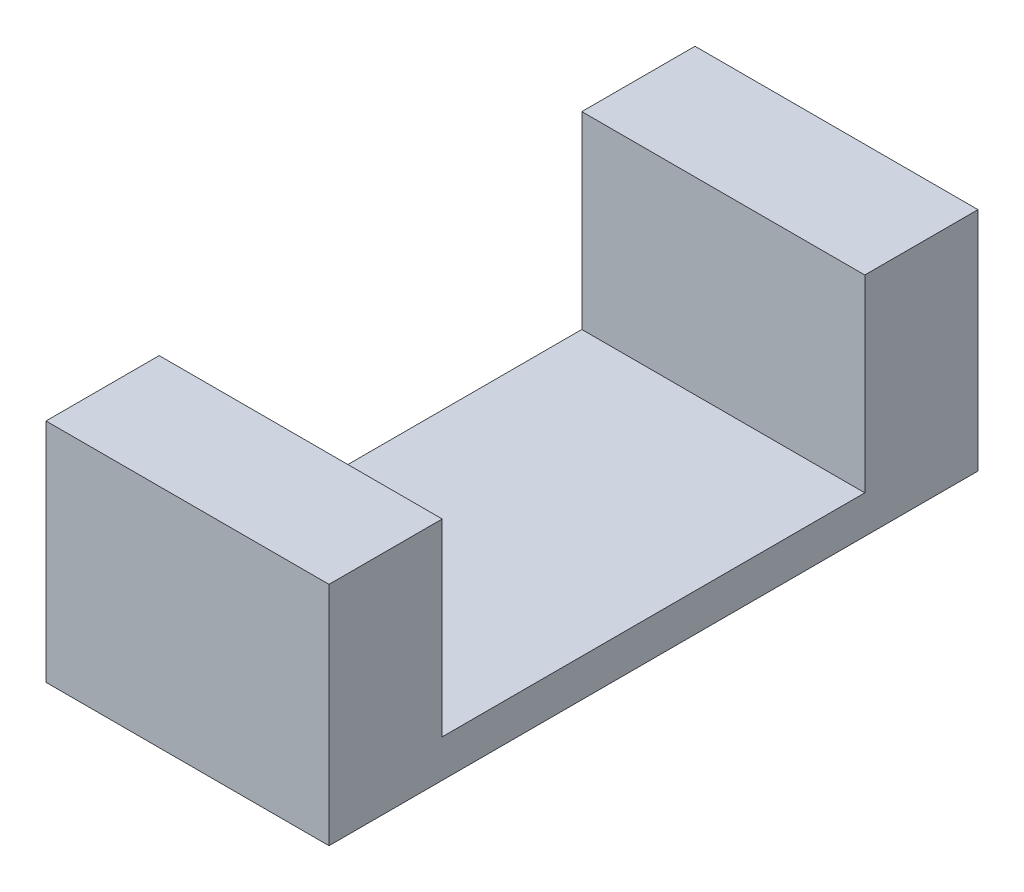
ISO-10303-21;
HEADER;
FILE_DESCRIPTION(('STEP AP214'),'2;1');
FILE_NAME('part.step','',(''),(''),'','','');
FILE_SCHEMA(('AUTOMOTIVE_DESIGN { 1 0 10303 214 1 1 1 1 }'));
ENDSEC;
DATA;
#1=APPLICATION_CONTEXT('core data for automotive mechanical design processes');
#2=APPLICATION_PROTOCOL_DEFINITION('international standard','automotive_design',2000,#1);
#3=PRODUCT_CONTEXT('',#1,'mechanical');
#4=PRODUCT('Part','Part','',(#3));
#5=PRODUCT_RELATED_PRODUCT_CATEGORY('part','',(#4));
#6=PRODUCT_DEFINITION_FORMATION('','',#4);
#7=PRODUCT_DEFINITION_CONTEXT('part definition',#1,'design');
#8=PRODUCT_DEFINITION('design','',#6,#7);
#9=PRODUCT_DEFINITION_SHAPE('','',#8);
#10=(LENGTH_UNIT() NAMED_UNIT(*) SI_UNIT(.MILLI.,.METRE.));
#11=(NAMED_UNIT(*) PLANE_ANGLE_UNIT() SI_UNIT($,.RADIAN.));
#12=(NAMED_UNIT(*) SI_UNIT($,.STERADIAN.) SOLID_ANGLE_UNIT());
#13=UNCERTAINTY_MEASURE_WITH_UNIT(LENGTH_MEASURE(1.E-05),#10,'distance_accuracy_value','');
#14=(GEOMETRIC_REPRESENTATION_CONTEXT(3) GLOBAL_UNCERTAINTY_ASSIGNED_CONTEXT((#13)) GLOBAL_UNIT_ASSIGNED_CONTEXT((#10,
#11,#12)) REPRESENTATION_CONTEXT('',''));
#15=CARTESIAN_POINT('',(0.,0.,0.));
#16=DIRECTION('',(0.,0.,1.));
#17=DIRECTION('',(1.,0.,0.));
#18=AXIS2_PLACEMENT_3D('',#15,#16,#17);
#19=CARTESIAN_POINT('',(20.5,2.77,13.36));
#20=DIRECTION('',(0.,0.,-1.));
#21=DIRECTION('',(-1.,0.,0.));
#22=AXIS2_PLACEMENT_3D('',#19,#20,#21);
#23=PLANE('',#22);
#24=DIRECTION('',(0.,1.,0.));
#25=VECTOR('',#24,1.);
#26=CARTESIAN_POINT('',(20.5,1.57,13.36));
#27=LINE('',#26,#25);
#28=CARTESIAN_POINT('',(20.5,1.77,13.36));
#29=VERTEX_POINT('',#28);
#30=CARTESIAN_POINT('',(20.5,2.77,13.36));
#31=VERTEX_POINT('',#30);
#32=EDGE_CURVE('E98',#29,#31,#27,.T.);
#33=ORIENTED_EDGE('',*,*,#32,.F.);
#34=DIRECTION('',(1.,0.,0.));
#35=VECTOR('',#34,1.);
#36=CARTESIAN_POINT('',(21.25,1.77,13.36));
#37=LINE('',#36,#35);
#38=CARTESIAN_POINT('',(22.,1.77,13.36));
#39=VERTEX_POINT('',#38);
#40=EDGE_CURVE('E97',#29,#39,#37,.T.);
#41=ORIENTED_EDGE('',*,*,#40,.T.);
#42=DIRECTION('',(0.,1.,0.));
#43=VECTOR('',#42,1.);
#44=CARTESIAN_POINT('',(22.,1.57,13.36));
#45=LINE('',#44,#43);
#46=CARTESIAN_POINT('',(22.,2.77,13.36));
#47=VERTEX_POINT('',#46);
#48=EDGE_CURVE('E84',#47,#39,#45,.F.);
#49=ORIENTED_EDGE('',*,*,#48,.F.);
#50=DIRECTION('',(1.,0.,0.));
#51=VECTOR('',#50,1.);
#52=CARTESIAN_POINT('',(21.25,2.77,13.36));
#53=LINE('',#52,#51);
#54=EDGE_CURVE('E20',#31,#47,#53,.T.);
#55=ORIENTED_EDGE('',*,*,#54,.F.);
#56=EDGE_LOOP('',(#33,#41,#49,#55));
#57=FACE_BOUND('',#56,.T.);
#58=ADVANCED_FACE('F17',(#57),#23,.F.);
#59=CARTESIAN_POINT('',(21.25,2.77,14.48));
#60=DIRECTION('',(0.,1.,0.));
#61=DIRECTION('',(0.,0.,1.));
#62=AXIS2_PLACEMENT_3D('',#59,#60,#61);
#63=PLANE('',#62);
#64=DIRECTION('',(-1.,0.,0.));
#65=VECTOR('',#64,1.);
#66=CARTESIAN_POINT('',(22.,2.77,12.76));
#67=LINE('',#66,#65);
#68=CARTESIAN_POINT('',(20.5,2.77,12.76));
#69=VERTEX_POINT('',#68);
#70=CARTESIAN_POINT('',(22.,2.77,12.76));
#71=VERTEX_POINT('',#70);
#72=EDGE_CURVE('E141',#69,#71,#67,.F.);
#73=ORIENTED_EDGE('',*,*,#72,.F.);
#74=DIRECTION('',(0.,0.,1.));
#75=VECTOR('',#74,1.);
#76=CARTESIAN_POINT('',(20.5,2.77,12.76));
#77=LINE('',#76,#75);
#78=EDGE_CURVE('E136',#31,#69,#77,.F.);
#79=ORIENTED_EDGE('',*,*,#78,.F.);
#80=ORIENTED_EDGE('',*,*,#54,.T.);
#81=DIRECTION('',(0.,0.,-1.));
#82=VECTOR('',#81,1.);
#83=CARTESIAN_POINT('',(22.,2.77,16.2));
#84=LINE('',#83,#82);
#85=EDGE_CURVE('E92',#71,#47,#84,.F.);
#86=ORIENTED_EDGE('',*,*,#85,.F.);
#87=EDGE_LOOP('',(#73,#79,#80,#86));
#88=FACE_BOUND('',#87,.T.);
#89=ADVANCED_FACE('F181',(#88),#63,.T.);
#90=CARTESIAN_POINT('',(21.25,2.77,14.48));
#91=DIRECTION('',(0.,1.,0.));
#92=DIRECTION('',(0.,0.,1.));
#93=AXIS2_PLACEMENT_3D('',#90,#91,#92);
#94=PLANE('',#93);
#95=DIRECTION('',(1.,0.,0.));
#96=VECTOR('',#95,1.);
#97=CARTESIAN_POINT('',(20.5,2.77,16.2));
#98=LINE('',#97,#96);
#99=CARTESIAN_POINT('',(22.,2.77,16.2));
#100=VERTEX_POINT('',#99);
#101=CARTESIAN_POINT('',(20.5,2.77,16.2));
#102=VERTEX_POINT('',#101);
#103=EDGE_CURVE('E94',#100,#102,#98,.F.);
#104=ORIENTED_EDGE('',*,*,#103,.F.);
#105=DIRECTION('',(0.,0.,-1.));
#106=VECTOR('',#105,1.);
#107=CARTESIAN_POINT('',(22.,2.77,16.2));
#108=LINE('',#107,#106);
#109=CARTESIAN_POINT('',(22.,2.77,15.6));
#110=VERTEX_POINT('',#109);
#111=EDGE_CURVE('E108',#110,#100,#108,.F.);
#112=ORIENTED_EDGE('',*,*,#111,.F.);
#113=DIRECTION('',(1.,0.,0.));
#114=VECTOR('',#113,1.);
#115=CARTESIAN_POINT('',(22.,2.77,15.6));
#116=LINE('',#115,#114);
#117=CARTESIAN_POINT('',(20.5,2.77,15.6));
#118=VERTEX_POINT('',#117);
#119=EDGE_CURVE('E113',#110,#118,#116,.F.);
#120=ORIENTED_EDGE('',*,*,#119,.T.);
#121=DIRECTION('',(0.,0.,1.));
#122=VECTOR('',#121,1.);
#123=CARTESIAN_POINT('',(20.5,2.77,12.76));
#124=LINE('',#123,#122);
#125=EDGE_CURVE('E121',#102,#118,#124,.F.);
#126=ORIENTED_EDGE('',*,*,#125,.F.);
#127=EDGE_LOOP('',(#104,#112,#120,#126));
#128=FACE_BOUND('',#127,.T.);
#129=ADVANCED_FACE('F120',(#128),#94,.T.);
#130=CARTESIAN_POINT('',(22.,2.77,15.6));
#131=DIRECTION('',(0.,0.,1.));
#132=DIRECTION('',(1.,0.,0.));
#133=AXIS2_PLACEMENT_3D('',#130,#131,#132);
#134=PLANE('',#133);
#135=DIRECTION('',(0.,1.,0.));
#136=VECTOR('',#135,1.);
#137=CARTESIAN_POINT('',(22.,1.57,15.6));
#138=LINE('',#137,#136);
#139=CARTESIAN_POINT('',(22.,1.77,15.6));
#140=VERTEX_POINT('',#139);
#141=EDGE_CURVE('E106',#140,#110,#138,.T.);
#142=ORIENTED_EDGE('',*,*,#141,.F.);
#143=DIRECTION('',(1.,0.,0.));
#144=VECTOR('',#143,1.);
#145=CARTESIAN_POINT('',(21.25,1.77,15.6));
#146=LINE('',#145,#144);
#147=CARTESIAN_POINT('',(20.5,1.77,15.6));
#148=VERTEX_POINT('',#147);
#149=EDGE_CURVE('E102',#140,#148,#146,.F.);
#150=ORIENTED_EDGE('',*,*,#149,.T.);
#151=DIRECTION('',(0.,1.,0.));
#152=VECTOR('',#151,1.);
#153=CARTESIAN_POINT('',(20.5,1.57,15.6));
#154=LINE('',#153,#152);
#155=EDGE_CURVE('E123',#118,#148,#154,.F.);
#156=ORIENTED_EDGE('',*,*,#155,.F.);
#157=ORIENTED_EDGE('',*,*,#119,.F.);
#158=EDGE_LOOP('',(#142,#150,#156,#157));
#159=FACE_BOUND('',#158,.T.);
#160=ADVANCED_FACE('F124',(#159),#134,.F.);
#161=CARTESIAN_POINT('',(21.25,1.77,14.48));
#162=DIRECTION('',(0.,-1.,0.));
#163=DIRECTION('',(0.,0.,-1.));
#164=AXIS2_PLACEMENT_3D('',#161,#162,#163);
#165=PLANE('',#164);
#166=DIRECTION('',(0.,0.,1.));
#167=VECTOR('',#166,1.);
#168=CARTESIAN_POINT('',(20.5,1.77,12.76));
#169=LINE('',#168,#167);
#170=EDGE_CURVE('E125',#148,#29,#169,.F.);
#171=ORIENTED_EDGE('',*,*,#170,.F.);
#172=ORIENTED_EDGE('',*,*,#149,.F.);
#173=DIRECTION('',(0.,0.,-1.));
#174=VECTOR('',#173,1.);
#175=CARTESIAN_POINT('',(22.,1.77,16.2));
#176=LINE('',#175,#174);
#177=EDGE_CURVE('E90',#39,#140,#176,.F.);
#178=ORIENTED_EDGE('',*,*,#177,.F.);
#179=ORIENTED_EDGE('',*,*,#40,.F.);
#180=EDGE_LOOP('',(#171,#172,#178,#179));
#181=FACE_BOUND('',#180,.T.);
#182=ADVANCED_FACE('F104',(#181),#165,.F.);
#183=CARTESIAN_POINT('',(20.5,1.57,16.2));
#184=DIRECTION('',(0.,0.,1.));
#185=DIRECTION('',(1.,0.,0.));
#186=AXIS2_PLACEMENT_3D('',#183,#184,#185);
#187=PLANE('',#186);
#188=ORIENTED_EDGE('',*,*,#103,.T.);
#189=DIRECTION('',(0.,1.,0.));
#190=VECTOR('',#189,1.);
#191=CARTESIAN_POINT('',(20.5,1.57,16.2));
#192=LINE('',#191,#190);
#193=CARTESIAN_POINT('',(20.5,1.57,16.2));
#194=VERTEX_POINT('',#193);
#195=EDGE_CURVE('E129',#194,#102,#192,.T.);
#196=ORIENTED_EDGE('',*,*,#195,.F.);
#197=DIRECTION('',(1.,0.,0.));
#198=VECTOR('',#197,1.);
#199=CARTESIAN_POINT('',(21.25,1.57,16.2));
#200=LINE('',#199,#198);
#201=CARTESIAN_POINT('',(22.,1.57,16.2));
#202=VERTEX_POINT('',#201);
#203=EDGE_CURVE('E127',#194,#202,#200,.T.);
#204=ORIENTED_EDGE('',*,*,#203,.T.);
#205=DIRECTION('',(0.,1.,0.));
#206=VECTOR('',#205,1.);
#207=CARTESIAN_POINT('',(22.,1.57,16.2));
#208=LINE('',#207,#206);
#209=EDGE_CURVE('E144',#100,#202,#208,.F.);
#210=ORIENTED_EDGE('',*,*,#209,.F.);
#211=EDGE_LOOP('',(#188,#196,#204,#210));
#212=FACE_BOUND('',#211,.T.);
#213=ADVANCED_FACE('F151',(#212),#187,.T.);
#214=CARTESIAN_POINT('',(22.,1.57,16.2));
#215=DIRECTION('',(1.,0.,0.));
#216=DIRECTION('',(0.,0.,-1.));
#217=AXIS2_PLACEMENT_3D('',#214,#215,#216);
#218=PLANE('',#217);
#219=DIRECTION('',(0.,1.,0.));
#220=VECTOR('',#219,1.);
#221=CARTESIAN_POINT('',(22.,1.57,12.76));
#222=LINE('',#221,#220);
#223=CARTESIAN_POINT('',(22.,1.57,12.76));
#224=VERTEX_POINT('',#223);
#225=EDGE_CURVE('E139',#71,#224,#222,.F.);
#226=ORIENTED_EDGE('',*,*,#225,.F.);
#227=ORIENTED_EDGE('',*,*,#85,.T.);
#228=ORIENTED_EDGE('',*,*,#48,.T.);
#229=ORIENTED_EDGE('',*,*,#177,.T.);
#230=ORIENTED_EDGE('',*,*,#141,.T.);
#231=ORIENTED_EDGE('',*,*,#111,.T.);
#232=ORIENTED_EDGE('',*,*,#209,.T.);
#233=DIRECTION('',(0.,0.,1.));
#234=VECTOR('',#233,1.);
#235=CARTESIAN_POINT('',(22.,1.57,14.48));
#236=LINE('',#235,#234);
#237=EDGE_CURVE('E153',#202,#224,#236,.F.);
#238=ORIENTED_EDGE('',*,*,#237,.T.);
#239=EDGE_LOOP('',(#226,#227,#228,#229,#230,#231,#232,#238));
#240=FACE_BOUND('',#239,.T.);
#241=ADVANCED_FACE('F87',(#240),#218,.T.);
#242=CARTESIAN_POINT('',(22.,1.57,12.76));
#243=DIRECTION('',(0.,0.,-1.));
#244=DIRECTION('',(-1.,0.,0.));
#245=AXIS2_PLACEMENT_3D('',#242,#243,#244);
#246=PLANE('',#245);
#247=ORIENTED_EDGE('',*,*,#72,.T.);
#248=ORIENTED_EDGE('',*,*,#225,.T.);
#249=DIRECTION('',(1.,0.,0.));
#250=VECTOR('',#249,1.);
#251=CARTESIAN_POINT('',(21.25,1.57,12.76));
#252=LINE('',#251,#250);
#253=CARTESIAN_POINT('',(20.5,1.57,12.76));
#254=VERTEX_POINT('',#253);
#255=EDGE_CURVE('E26',#224,#254,#252,.F.);
#256=ORIENTED_EDGE('',*,*,#255,.T.);
#257=DIRECTION('',(0.,1.,0.));
#258=VECTOR('',#257,1.);
#259=CARTESIAN_POINT('',(20.5,1.57,12.76));
#260=LINE('',#259,#258);
#261=EDGE_CURVE('E34',#69,#254,#260,.F.);
#262=ORIENTED_EDGE('',*,*,#261,.F.);
#263=EDGE_LOOP('',(#247,#248,#256,#262));
#264=FACE_BOUND('',#263,.T.);
#265=ADVANCED_FACE('F159',(#264),#246,.T.);
#266=CARTESIAN_POINT('',(20.5,1.57,12.76));
#267=DIRECTION('',(-1.,0.,0.));
#268=DIRECTION('',(0.,0.,1.));
#269=AXIS2_PLACEMENT_3D('',#266,#267,#268);
#270=PLANE('',#269);
#271=ORIENTED_EDGE('',*,*,#155,.T.);
#272=ORIENTED_EDGE('',*,*,#170,.T.);
#273=ORIENTED_EDGE('',*,*,#32,.T.);
#274=ORIENTED_EDGE('',*,*,#78,.T.);
#275=ORIENTED_EDGE('',*,*,#261,.T.);
#276=DIRECTION('',(0.,0.,1.));
#277=VECTOR('',#276,1.);
#278=CARTESIAN_POINT('',(20.5,1.57,14.48));
#279=LINE('',#278,#277);
#280=EDGE_CURVE('E11',#254,#194,#279,.T.);
#281=ORIENTED_EDGE('',*,*,#280,.T.);
#282=ORIENTED_EDGE('',*,*,#195,.T.);
#283=ORIENTED_EDGE('',*,*,#125,.T.);
#284=EDGE_LOOP('',(#271,#272,#273,#274,#275,#281,#282,#283));
#285=FACE_BOUND('',#284,.T.);
#286=ADVANCED_FACE('F161',(#285),#270,.T.);
#287=CARTESIAN_POINT('',(21.25,1.57,14.48));
#288=DIRECTION('',(0.,1.,0.));
#289=DIRECTION('',(0.,0.,1.));
#290=AXIS2_PLACEMENT_3D('',#287,#288,#289);
#291=PLANE('',#290);
#292=ORIENTED_EDGE('',*,*,#255,.F.);
#293=ORIENTED_EDGE('',*,*,#237,.F.);
#294=ORIENTED_EDGE('',*,*,#203,.F.);
#295=ORIENTED_EDGE('',*,*,#280,.F.);
#296=EDGE_LOOP('',(#292,#293,#294,#295));
#297=FACE_BOUND('',#296,.T.);
#298=ADVANCED_FACE('F160',(#297),#291,.F.);
#299=CLOSED_SHELL('',(#58,#89,#129,#160,#182,#213,#241,#265,#286,#298));
#300=MANIFOLD_SOLID_BREP('B1',#299);
#301=ADVANCED_BREP_SHAPE_REPRESENTATION('',(#18,#300),#14);
#302=SHAPE_DEFINITION_REPRESENTATION(#9,#301);
ENDSEC;
END-ISO-10303-21;
